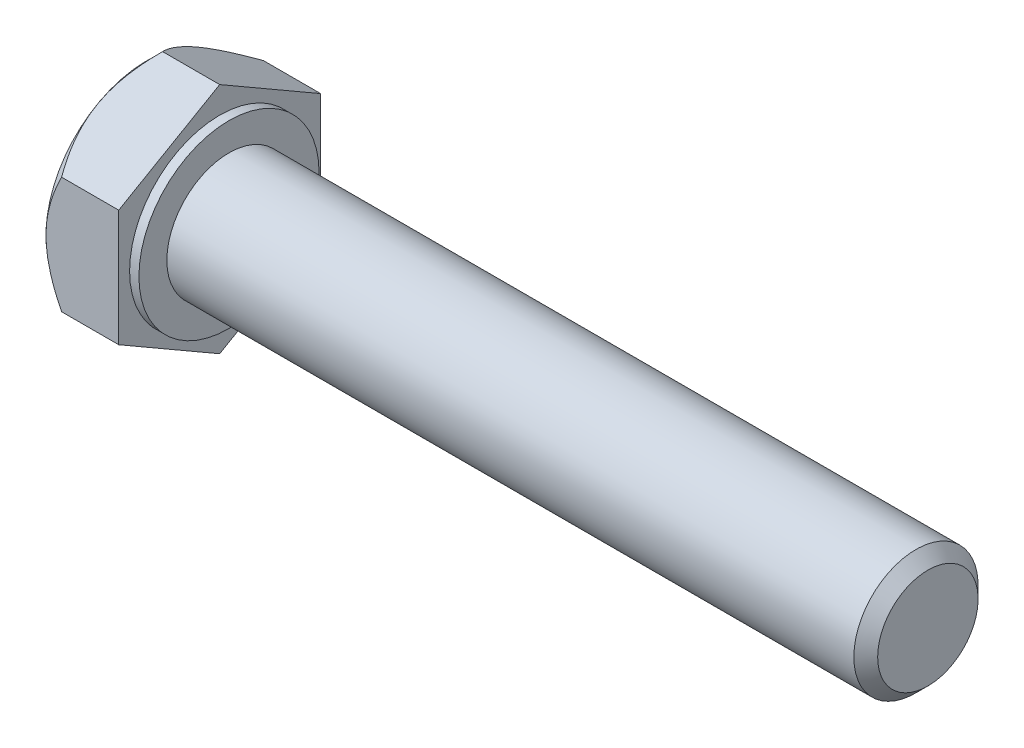
ISO-10303-21;
HEADER;
FILE_DESCRIPTION(('STEP AP214'),'2;1');
FILE_NAME('part.step','',(''),(''),'','','');
FILE_SCHEMA(('AUTOMOTIVE_DESIGN { 1 0 10303 214 1 1 1 1 }'));
ENDSEC;
DATA;
#1=APPLICATION_CONTEXT('core data for automotive mechanical design processes');
#2=APPLICATION_PROTOCOL_DEFINITION('international standard','automotive_design',2000,#1);
#3=PRODUCT_CONTEXT('',#1,'mechanical');
#4=PRODUCT('Part','Part','',(#3));
#5=PRODUCT_RELATED_PRODUCT_CATEGORY('part','',(#4));
#6=PRODUCT_DEFINITION_FORMATION('','',#4);
#7=PRODUCT_DEFINITION_CONTEXT('part definition',#1,'design');
#8=PRODUCT_DEFINITION('design','',#6,#7);
#9=PRODUCT_DEFINITION_SHAPE('','',#8);
#10=(LENGTH_UNIT() NAMED_UNIT(*) SI_UNIT(.MILLI.,.METRE.));
#11=(NAMED_UNIT(*) PLANE_ANGLE_UNIT() SI_UNIT($,.RADIAN.));
#12=(NAMED_UNIT(*) SI_UNIT($,.STERADIAN.) SOLID_ANGLE_UNIT());
#13=UNCERTAINTY_MEASURE_WITH_UNIT(LENGTH_MEASURE(1.E-05),#10,'distance_accuracy_value','');
#14=(GEOMETRIC_REPRESENTATION_CONTEXT(3) GLOBAL_UNCERTAINTY_ASSIGNED_CONTEXT((#13)) GLOBAL_UNIT_ASSIGNED_CONTEXT((#10,
#11,#12)) REPRESENTATION_CONTEXT('',''));
#15=CARTESIAN_POINT('',(0.,0.,0.));
#16=DIRECTION('',(0.,0.,1.));
#17=DIRECTION('',(1.,0.,0.));
#18=AXIS2_PLACEMENT_3D('',#15,#16,#17);
#19=CARTESIAN_POINT('',(0.,0.,0.));
#20=DIRECTION('',(1.,0.,0.));
#21=DIRECTION('',(0.,0.,-1.));
#22=AXIS2_PLACEMENT_3D('',#19,#20,#21);
#23=PLANE('',#22);
#24=CARTESIAN_POINT('',(-5.6843418860808E-11,0.,0.));
#25=DIRECTION('',(1.,0.,0.));
#26=DIRECTION('',(0.,0.,-1.));
#27=AXIS2_PLACEMENT_3D('',#24,#25,#26);
#28=CIRCLE('',#27,6.4841770377484);
#29=CARTESIAN_POINT('',(-5.6843418860808E-11,0.,-6.4841770377484));
#30=VERTEX_POINT('',#29);
#31=EDGE_CURVE('E86',#30,#30,#28,.T.);
#32=ORIENTED_EDGE('',*,*,#31,.F.);
#33=EDGE_LOOP('',(#32));
#34=FACE_BOUND('',#33,.T.);
#35=ADVANCED_FACE('F17',(#34),#23,.F.);
#36=CARTESIAN_POINT('',(1.02750472035495,0.,0.));
#37=DIRECTION('',(1.,0.,0.));
#38=DIRECTION('',(0.,0.,-1.));
#39=AXIS2_PLACEMENT_3D('',#36,#37,#38);
#40=CONICAL_SURFACE('',#39,7.51168175816019,0.785398163397448);
#41=ORIENTED_EDGE('',*,*,#31,.T.);
#42=EDGE_LOOP('',(#41));
#43=FACE_BOUND('',#42,.T.);
#44=CARTESIAN_POINT('',(1.02137646167367,-7.50555349946932,-2.08076854605376E-11));
#45=CARTESIAN_POINT('',(0.956863348740316,-7.44103070347889,0.111756760889576));
#46=CARTESIAN_POINT('',(0.894330169112702,-7.37601197251588,0.224372506364791));
#47=CARTESIAN_POINT('',(0.773825914126035,-7.24488536401594,0.451490454513631));
#48=CARTESIAN_POINT('',(0.715857330101363,-7.17877691519486,0.565993646680406));
#49=CARTESIAN_POINT('',(0.549207608741091,-6.97805705245591,0.913650647031087));
#50=CARTESIAN_POINT('',(0.448493296490026,-6.84174655858952,1.14974734801319));
#51=CARTESIAN_POINT('',(0.276027544551549,-6.56686563660067,1.62585507092975));
#52=CARTESIAN_POINT('',(0.203841659133473,-6.42836544797367,1.86574443448939));
#53=CARTESIAN_POINT('',(0.120340749585083,-6.21833845254527,2.22952186153234));
#54=CARTESIAN_POINT('',(0.0966479300984003,-6.14802026813678,2.35131652962386));
#55=CARTESIAN_POINT('',(0.0580576827015403,-6.00678859048912,2.5959369709478));
#56=CARTESIAN_POINT('',(0.043158940716158,-5.93587518779878,2.71876258734507));
#57=CARTESIAN_POINT('',(0.0181784039369678,-5.76306282402912,3.01808238157018));
#58=CARTESIAN_POINT('',(0.0129377529325743,-5.66097765373195,3.19489908322421));
#59=CARTESIAN_POINT('',(0.0217387822876304,-5.45699137253924,3.54821368629703));
#60=CARTESIAN_POINT('',(0.035787221277361,-5.35509033869147,3.72471145426515));
#61=CARTESIAN_POINT('',(0.0823383285782922,-5.15224904988364,4.07604287235307));
#62=CARTESIAN_POINT('',(0.114861629603941,-5.05130999763312,4.25087443931882));
#63=CARTESIAN_POINT('',(0.196594315231749,-4.85116681412106,4.59753260195028));
#64=CARTESIAN_POINT('',(0.245802420146347,-4.75196255041853,4.76935942701053));
#65=CARTESIAN_POINT('',(0.347031256569281,-4.57586927649479,5.07436192431759));
#66=CARTESIAN_POINT('',(0.39638818776403,-4.4985901066428,5.20821337286799));
#67=CARTESIAN_POINT('',(0.50305460921505,-4.34541880414507,5.47351385105556));
#68=CARTESIAN_POINT('',(0.560364339235519,-4.26952671339565,5.60496280812617));
#69=CARTESIAN_POINT('',(0.681651981959655,-4.11936862445095,5.86504424734585));
#70=CARTESIAN_POINT('',(0.745608922548562,-4.04509835593153,5.99368412591326));
#71=CARTESIAN_POINT('',(0.879351576193868,-3.89793287352954,6.2485822185539));
#72=CARTESIAN_POINT('',(0.949133717029406,-3.82503685004989,6.37484183489038));
#73=CARTESIAN_POINT('',(1.02137646167042,-3.75277674972205,6.50000000001823));
#74=B_SPLINE_CURVE_WITH_KNOTS('',3,(#44,#45,#46,#47,#48,#49,#50,#51,#52,#53,#54,#55,#56,#57,#58,
#59,#60,#61,#62,#63,#64,#65,#66,#67,#68,#69,#70,#71,#72,#73),.UNSPECIFIED.,.F.,.F.,(4,2,2,2,2,2,
2,2,2,2,2,2,2,2,4),(0.,0.432793757371348,0.865822117364595,1.73655298412524,2.59345958881553,
3.021072682735,3.44862186340034,4.06038261741554,4.67235777864492,5.28501774083525,
5.89763072398653,6.38414619494485,6.87067633675643,7.35571555795712,7.84045949061832),.UNSPECIFIED.);
#75=CARTESIAN_POINT('',(1.0213764616707,-7.50555349947593,0.));
#76=VERTEX_POINT('',#75);
#77=CARTESIAN_POINT('',(1.0213764616707,-3.75277674973797,6.50000000000935));
#78=VERTEX_POINT('',#77);
#79=EDGE_CURVE('E68',#76,#78,#74,.T.);
#80=ORIENTED_EDGE('',*,*,#79,.T.);
#81=CARTESIAN_POINT('',(1.02137646167367,-3.75277674975268,6.49999999999322));
#82=CARTESIAN_POINT('',(0.956863348740316,-3.62373115776441,6.4999999999975));
#83=CARTESIAN_POINT('',(0.894330169112703,-3.49369369583525,6.49999999999932));
#84=CARTESIAN_POINT('',(0.773825914126036,-3.23144047883298,6.50000000000069));
#85=CARTESIAN_POINT('',(0.715857330101364,-3.09922358119161,6.50000000000024));
#86=CARTESIAN_POINT('',(0.549207608741092,-2.69778385571495,6.49999999999952));
#87=CARTESIAN_POINT('',(0.448493296490026,-2.42516286798156,6.49999999999988));
#88=CARTESIAN_POINT('',(0.276027544551549,-1.87540102400343,6.50000000000012));
#89=CARTESIAN_POINT('',(0.203841659133473,-1.59840064674959,6.50000000000002));
#90=CARTESIAN_POINT('',(0.120340749585082,-1.17834665589286,6.49999999999999));
#91=CARTESIAN_POINT('',(0.0966479300983987,-1.03771028707586,6.5));
#92=CARTESIAN_POINT('',(0.0580576827015386,-0.755246931780536,6.5));
#93=CARTESIAN_POINT('',(0.043158940716157,-0.613420126399845,6.5));
#94=CARTESIAN_POINT('',(0.0181784039369671,-0.267795398860543,6.5));
#95=CARTESIAN_POINT('',(0.0129377529325726,-0.0636250582661894,6.5));
#96=CARTESIAN_POINT('',(0.0217387822876289,0.344347504119238,6.5));
#97=CARTESIAN_POINT('',(0.0357872212773607,0.54814957181477,6.5));
#98=CARTESIAN_POINT('',(0.082338328578292,0.953832149430432,6.5));
#99=CARTESIAN_POINT('',(0.114861629603939,1.15571025393147,6.5));
#100=CARTESIAN_POINT('',(0.196594315231747,1.55599662095558,6.5));
#101=CARTESIAN_POINT('',(0.245802420146346,1.75440514836065,6.5));
#102=CARTESIAN_POINT('',(0.347031256569281,2.10659169620813,6.5));
#103=CARTESIAN_POINT('',(0.396388187764029,2.26115003591211,6.5));
#104=CARTESIAN_POINT('',(0.503054609215049,2.56749264090757,6.5));
#105=CARTESIAN_POINT('',(0.560364339235518,2.7192768224064,6.5));
#106=CARTESIAN_POINT('',(0.681651981959655,3.01959300029581,6.5));
#107=CARTESIAN_POINT('',(0.745608922548561,3.16813353733465,6.5));
#108=CARTESIAN_POINT('',(0.879351576193866,3.46246450213863,6.5));
#109=CARTESIAN_POINT('',(0.949133717029405,3.60825654909793,6.5));
#110=CARTESIAN_POINT('',(1.02137646167042,3.75277674975362,6.5));
#111=B_SPLINE_CURVE_WITH_KNOTS('',3,(#81,#82,#83,#84,#85,#86,#87,#88,#89,#90,#91,#92,#93,#94,
#95,#96,#97,#98,#99,#100,#101,#102,#103,#104,#105,#106,#107,#108,#109,#110),.UNSPECIFIED.,.F.,
.F.,(4,2,2,2,2,2,2,2,2,2,2,2,2,2,4),(0.,0.432793757371348,0.865822117364594,1.73655298412524,
2.59345958881554,3.021072682735,3.44862186340035,4.06038261741554,4.67235777864492,
5.28501774083526,5.89763072398654,6.38414619494486,6.87067633675644,7.35571555795712,
7.84045949061832),.UNSPECIFIED.);
#112=CARTESIAN_POINT('',(1.0213764616653,3.75277674974337,6.5));
#113=VERTEX_POINT('',#112);
#114=EDGE_CURVE('E71',#78,#113,#111,.T.);
#115=ORIENTED_EDGE('',*,*,#114,.T.);
#116=CARTESIAN_POINT('',(1.02137646167367,3.75277674971664,6.50000000001403));
#117=CARTESIAN_POINT('',(0.956863348740314,3.81729954571448,6.38824323910793));
#118=CARTESIAN_POINT('',(0.894330169112701,3.88231827668063,6.27562749363453));
#119=CARTESIAN_POINT('',(0.773825914126032,4.01344488518295,6.04850954548705));
#120=CARTESIAN_POINT('',(0.71585733010136,4.07955333400325,5.93400635331983));
#121=CARTESIAN_POINT('',(0.549207608741086,4.28027319674096,5.58634935296843));
#122=CARTESIAN_POINT('',(0.448493296490022,4.41658369060796,5.35025265198669));
#123=CARTESIAN_POINT('',(0.276027544551545,4.69146461259724,4.87414492907038));
#124=CARTESIAN_POINT('',(0.203841659133469,4.82996480122407,4.63425556551063));
#125=CARTESIAN_POINT('',(0.120340749585078,5.03999179665241,4.27047813846764));
#126=CARTESIAN_POINT('',(0.0966479300983942,5.11030998106092,4.14868347037613));
#127=CARTESIAN_POINT('',(0.0580576827015339,5.25154165870858,3.90406302905219));
#128=CARTESIAN_POINT('',(0.0431589407161522,5.32245506139893,3.78123741265492));
#129=CARTESIAN_POINT('',(0.0181784039369623,5.49526742516858,3.48191761842981));
#130=CARTESIAN_POINT('',(0.0129377529325681,5.59735259546575,3.30510091677578));
#131=CARTESIAN_POINT('',(0.0217387822876244,5.80133887665847,2.95178631370297));
#132=CARTESIAN_POINT('',(0.035787221277356,5.90323991050623,2.77528854573484));
#133=CARTESIAN_POINT('',(0.0823383285782876,6.10608119931406,2.42395712764693));
#134=CARTESIAN_POINT('',(0.114861629603936,6.20702025156459,2.24912556068118));
#135=CARTESIAN_POINT('',(0.196594315231743,6.40716343507664,1.90246739804972));
#136=CARTESIAN_POINT('',(0.245802420146341,6.50636769877917,1.73064057298947));
#137=CARTESIAN_POINT('',(0.347031256569276,6.68246097270291,1.42563807568241));
#138=CARTESIAN_POINT('',(0.396388187764025,6.75974014255491,1.29178662713201));
#139=CARTESIAN_POINT('',(0.503054609215045,6.91291144505263,1.02648614894444));
#140=CARTESIAN_POINT('',(0.560364339235514,6.98880353580205,0.895037191873826));
#141=CARTESIAN_POINT('',(0.681651981959651,7.13896162474675,0.63495575265415));
#142=CARTESIAN_POINT('',(0.745608922548557,7.21323189326617,0.506315874086734));
#143=CARTESIAN_POINT('',(0.879351576193862,7.36039737566816,0.251417781446103));
#144=CARTESIAN_POINT('',(0.9491337170294,7.43329339914781,0.125158165109614));
#145=CARTESIAN_POINT('',(1.02137646167042,7.50555349947566,-1.8231203927878E-11));
#146=B_SPLINE_CURVE_WITH_KNOTS('',3,(#116,#117,#118,#119,#120,#121,#122,#123,#124,#125,#126,
#127,#128,#129,#130,#131,#132,#133,#134,#135,#136,#137,#138,#139,#140,#141,#142,#143,#144,#145),
.UNSPECIFIED.,.F.,.F.,(4,2,2,2,2,2,2,2,2,2,2,2,2,2,4),(0.,0.432793757371349,0.865822117364596,
1.73655298412524,2.59345958881554,3.02107268273501,3.44862186340035,4.06038261741555,
4.67235777864493,5.28501774083526,5.89763072398654,6.38414619494486,6.87067633675644,
7.35571555795712,7.84045949061833),.UNSPECIFIED.);
#147=CARTESIAN_POINT('',(1.02137646167069,7.50555349947593,0.));
#148=VERTEX_POINT('',#147);
#149=EDGE_CURVE('E145',#113,#148,#146,.T.);
#150=ORIENTED_EDGE('',*,*,#149,.T.);
#151=CARTESIAN_POINT('',(1.02137646167367,7.50555349946932,2.0807260441963E-11));
#152=CARTESIAN_POINT('',(0.956863348740315,7.44103070347889,-0.111756760889577));
#153=CARTESIAN_POINT('',(0.894330169112702,7.37601197251588,-0.224372506364792));
#154=CARTESIAN_POINT('',(0.773825914126035,7.24488536401594,-0.451490454513632));
#155=CARTESIAN_POINT('',(0.715857330101363,7.17877691519486,-0.565993646680407));
#156=CARTESIAN_POINT('',(0.549207608741091,6.97805705245591,-0.913650647031087));
#157=CARTESIAN_POINT('',(0.448493296490026,6.84174655858952,-1.14974734801319));
#158=CARTESIAN_POINT('',(0.276027544551548,6.56686563660067,-1.62585507092975));
#159=CARTESIAN_POINT('',(0.203841659133473,6.42836544797367,-1.86574443448939));
#160=CARTESIAN_POINT('',(0.120340749585083,6.21833845254527,-2.22952186153234));
#161=CARTESIAN_POINT('',(0.0966479300983999,6.14802026813678,-2.35131652962386));
#162=CARTESIAN_POINT('',(0.0580576827015398,6.00678859048912,-2.5959369709478));
#163=CARTESIAN_POINT('',(0.0431589407161576,5.93587518779878,-2.71876258734507));
#164=CARTESIAN_POINT('',(0.0181784039369676,5.76306282402912,-3.01808238157018));
#165=CARTESIAN_POINT('',(0.0129377529325742,5.66097765373195,-3.19489908322421));
#166=CARTESIAN_POINT('',(0.0217387822876305,5.45699137253924,-3.54821368629703));
#167=CARTESIAN_POINT('',(0.0357872212773611,5.35509033869147,-3.72471145426515));
#168=CARTESIAN_POINT('',(0.0823383285782919,5.15224904988364,-4.07604287235307));
#169=CARTESIAN_POINT('',(0.11486162960394,5.05130999763312,-4.25087443931882));
#170=CARTESIAN_POINT('',(0.196594315231748,4.85116681412107,-4.59753260195028));
#171=CARTESIAN_POINT('',(0.245802420146347,4.75196255041853,-4.76935942701053));
#172=CARTESIAN_POINT('',(0.347031256569281,4.57586927649479,-5.07436192431759));
#173=CARTESIAN_POINT('',(0.39638818776403,4.4985901066428,-5.20821337286799));
#174=CARTESIAN_POINT('',(0.50305460921505,4.34541880414507,-5.47351385105555));
#175=CARTESIAN_POINT('',(0.560364339235519,4.26952671339565,-5.60496280812617));
#176=CARTESIAN_POINT('',(0.681651981959656,4.11936862445095,-5.86504424734585));
#177=CARTESIAN_POINT('',(0.745608922548562,4.04509835593153,-5.99368412591326));
#178=CARTESIAN_POINT('',(0.879351576193868,3.89793287352954,-6.2485822185539));
#179=CARTESIAN_POINT('',(0.949133717029406,3.82503685004989,-6.37484183489039));
#180=CARTESIAN_POINT('',(1.02137646167042,3.75277674972205,-6.50000000001823));
#181=B_SPLINE_CURVE_WITH_KNOTS('',3,(#151,#152,#153,#154,#155,#156,#157,#158,#159,#160,#161,
#162,#163,#164,#165,#166,#167,#168,#169,#170,#171,#172,#173,#174,#175,#176,#177,#178,#179,#180),
.UNSPECIFIED.,.F.,.F.,(4,2,2,2,2,2,2,2,2,2,2,2,2,2,4),(0.,0.432793757371348,0.865822117364594,
1.73655298412524,2.59345958881553,3.021072682735,3.44862186340034,4.06038261741554,
4.67235777864491,5.28501774083525,5.89763072398653,6.38414619494485,6.87067633675643,
7.35571555795711,7.84045949061832),.UNSPECIFIED.);
#182=CARTESIAN_POINT('',(1.0213764616707,3.75277674973797,-6.50000000000935));
#183=VERTEX_POINT('',#182);
#184=EDGE_CURVE('E152',#148,#183,#181,.T.);
#185=ORIENTED_EDGE('',*,*,#184,.T.);
#186=CARTESIAN_POINT('',(1.02137646167367,3.75277674975268,-6.49999999999322));
#187=CARTESIAN_POINT('',(0.956863348740317,3.62373115776441,-6.4999999999975));
#188=CARTESIAN_POINT('',(0.894330169112704,3.49369369583525,-6.49999999999932));
#189=CARTESIAN_POINT('',(0.773825914126036,3.23144047883298,-6.50000000000069));
#190=CARTESIAN_POINT('',(0.715857330101364,3.09922358119161,-6.50000000000024));
#191=CARTESIAN_POINT('',(0.549207608741091,2.69778385571495,-6.49999999999952));
#192=CARTESIAN_POINT('',(0.448493296490026,2.42516286798156,-6.49999999999988));
#193=CARTESIAN_POINT('',(0.276027544551549,1.87540102400343,-6.50000000000012));
#194=CARTESIAN_POINT('',(0.203841659133473,1.59840064674959,-6.50000000000002));
#195=CARTESIAN_POINT('',(0.120340749585082,1.17834665589286,-6.49999999999999));
#196=CARTESIAN_POINT('',(0.0966479300983986,1.03771028707586,-6.5));
#197=CARTESIAN_POINT('',(0.0580576827015386,0.755246931780538,-6.5));
#198=CARTESIAN_POINT('',(0.043158940716157,0.613420126399847,-6.5));
#199=CARTESIAN_POINT('',(0.0181784039369672,0.267795398860545,-6.5));
#200=CARTESIAN_POINT('',(0.0129377529325727,0.0636250582661907,-6.5));
#201=CARTESIAN_POINT('',(0.021738782287629,-0.344347504119236,-6.5));
#202=CARTESIAN_POINT('',(0.0357872212773607,-0.548149571814768,-6.5));
#203=CARTESIAN_POINT('',(0.0823383285782919,-0.95383214943043,-6.5));
#204=CARTESIAN_POINT('',(0.114861629603939,-1.15571025393147,-6.5));
#205=CARTESIAN_POINT('',(0.196594315231747,-1.55599662095558,-6.5));
#206=CARTESIAN_POINT('',(0.245802420146346,-1.75440514836065,-6.5));
#207=CARTESIAN_POINT('',(0.34703125656928,-2.10659169620813,-6.5));
#208=CARTESIAN_POINT('',(0.396388187764029,-2.26115003591211,-6.5));
#209=CARTESIAN_POINT('',(0.503054609215048,-2.56749264090757,-6.5));
#210=CARTESIAN_POINT('',(0.560364339235517,-2.7192768224064,-6.5));
#211=CARTESIAN_POINT('',(0.681651981959654,-3.01959300029581,-6.5));
#212=CARTESIAN_POINT('',(0.745608922548559,-3.16813353733465,-6.5));
#213=CARTESIAN_POINT('',(0.879351576193864,-3.46246450213863,-6.5));
#214=CARTESIAN_POINT('',(0.949133717029402,-3.60825654909793,-6.5));
#215=CARTESIAN_POINT('',(1.02137646167042,-3.75277674975361,-6.5));
#216=B_SPLINE_CURVE_WITH_KNOTS('',3,(#186,#187,#188,#189,#190,#191,#192,#193,#194,#195,#196,
#197,#198,#199,#200,#201,#202,#203,#204,#205,#206,#207,#208,#209,#210,#211,#212,#213,#214,#215),
.UNSPECIFIED.,.F.,.F.,(4,2,2,2,2,2,2,2,2,2,2,2,2,2,4),(0.,0.432793757371348,0.865822117364595,
1.73655298412524,2.59345958881554,3.021072682735,3.44862186340035,4.06038261741554,
4.67235777864492,5.28501774083526,5.89763072398654,6.38414619494485,6.87067633675643,
7.35571555795712,7.84045949061832),.UNSPECIFIED.);
#217=CARTESIAN_POINT('',(1.0213764616707,-3.75277674973796,-6.50000000000935));
#218=VERTEX_POINT('',#217);
#219=EDGE_CURVE('E177',#183,#218,#216,.T.);
#220=ORIENTED_EDGE('',*,*,#219,.T.);
#221=CARTESIAN_POINT('',(1.02137646167367,-3.75277674971663,-6.50000000001403));
#222=CARTESIAN_POINT('',(0.956863348740315,-3.81729954571448,-6.38824323910793));
#223=CARTESIAN_POINT('',(0.894330169112702,-3.88231827668063,-6.27562749363453));
#224=CARTESIAN_POINT('',(0.773825914126033,-4.01344488518295,-6.04850954548706));
#225=CARTESIAN_POINT('',(0.715857330101361,-4.07955333400325,-5.93400635331984));
#226=CARTESIAN_POINT('',(0.549207608741087,-4.28027319674096,-5.58634935296843));
#227=CARTESIAN_POINT('',(0.448493296490022,-4.41658369060796,-5.35025265198669));
#228=CARTESIAN_POINT('',(0.276027544551545,-4.69146461259724,-4.87414492907038));
#229=CARTESIAN_POINT('',(0.203841659133468,-4.82996480122407,-4.63425556551063));
#230=CARTESIAN_POINT('',(0.120340749585077,-5.03999179665241,-4.27047813846765));
#231=CARTESIAN_POINT('',(0.0966479300983943,-5.11030998106092,-4.14868347037613));
#232=CARTESIAN_POINT('',(0.058057682701534,-5.25154165870858,-3.9040630290522));
#233=CARTESIAN_POINT('',(0.0431589407161519,-5.32245506139893,-3.78123741265493));
#234=CARTESIAN_POINT('',(0.0181784039369617,-5.49526742516857,-3.48191761842981));
#235=CARTESIAN_POINT('',(0.0129377529325679,-5.59735259546575,-3.30510091677578));
#236=CARTESIAN_POINT('',(0.0217387822876245,-5.80133887665847,-2.95178631370297));
#237=CARTESIAN_POINT('',(0.035787221277356,-5.90323991050623,-2.77528854573485));
#238=CARTESIAN_POINT('',(0.0823383285782872,-6.10608119931406,-2.42395712764693));
#239=CARTESIAN_POINT('',(0.114861629603935,-6.20702025156458,-2.24912556068118));
#240=CARTESIAN_POINT('',(0.196594315231742,-6.40716343507664,-1.90246739804972));
#241=CARTESIAN_POINT('',(0.245802420146341,-6.50636769877917,-1.73064057298947));
#242=CARTESIAN_POINT('',(0.347031256569275,-6.68246097270291,-1.42563807568241));
#243=CARTESIAN_POINT('',(0.396388187764024,-6.7597401425549,-1.29178662713201));
#244=CARTESIAN_POINT('',(0.503054609215044,-6.91291144505263,-1.02648614894444));
#245=CARTESIAN_POINT('',(0.560364339235513,-6.98880353580205,-0.895037191873828));
#246=CARTESIAN_POINT('',(0.68165198195965,-7.13896162474675,-0.634955752654151));
#247=CARTESIAN_POINT('',(0.745608922548556,-7.21323189326617,-0.506315874086734));
#248=CARTESIAN_POINT('',(0.879351576193862,-7.36039737566816,-0.251417781446102));
#249=CARTESIAN_POINT('',(0.949133717029401,-7.43329339914781,-0.125158165109613));
#250=CARTESIAN_POINT('',(1.02137646167042,-7.50555349947566,1.82324864022605E-11));
#251=B_SPLINE_CURVE_WITH_KNOTS('',3,(#221,#222,#223,#224,#225,#226,#227,#228,#229,#230,#231,
#232,#233,#234,#235,#236,#237,#238,#239,#240,#241,#242,#243,#244,#245,#246,#247,#248,#249,#250),
.UNSPECIFIED.,.F.,.F.,(4,2,2,2,2,2,2,2,2,2,2,2,2,2,4),(0.,0.432793757371349,0.865822117364596,
1.73655298412524,2.59345958881554,3.02107268273501,3.44862186340035,4.06038261741554,
4.67235777864492,5.28501774083526,5.89763072398654,6.38414619494486,6.87067633675644,
7.35571555795712,7.84045949061833),.UNSPECIFIED.);
#252=EDGE_CURVE('E74',#218,#76,#251,.T.);
#253=ORIENTED_EDGE('',*,*,#252,.T.);
#254=EDGE_LOOP('',(#80,#115,#150,#185,#220,#253));
#255=FACE_BOUND('',#254,.T.);
#256=ADVANCED_FACE('F70',(#43,#255),#40,.T.);
#257=CARTESIAN_POINT('',(4.7,3.75277674973257,6.5));
#258=DIRECTION('',(0.,0.,-1.));
#259=DIRECTION('',(-1.,0.,0.));
#260=AXIS2_PLACEMENT_3D('',#257,#258,#259);
#261=PLANE('',#260);
#262=ORIENTED_EDGE('',*,*,#114,.F.);
#263=DIRECTION('',(1.,0.,0.));
#264=VECTOR('',#263,1.);
#265=CARTESIAN_POINT('',(4.7,-3.75277674973257,6.5));
#266=LINE('',#265,#264);
#267=CARTESIAN_POINT('',(4.7,-3.75277674973257,6.5));
#268=VERTEX_POINT('',#267);
#269=EDGE_CURVE('E78',#78,#268,#266,.T.);
#270=ORIENTED_EDGE('',*,*,#269,.T.);
#271=DIRECTION('',(0.,1.,0.));
#272=VECTOR('',#271,1.);
#273=CARTESIAN_POINT('',(4.7,0.,6.5));
#274=LINE('',#273,#272);
#275=CARTESIAN_POINT('',(4.7,3.75277674973257,6.5));
#276=VERTEX_POINT('',#275);
#277=EDGE_CURVE('E113',#276,#268,#274,.F.);
#278=ORIENTED_EDGE('',*,*,#277,.F.);
#279=DIRECTION('',(1.,0.,0.));
#280=VECTOR('',#279,1.);
#281=CARTESIAN_POINT('',(4.7,3.75277674973256,6.5));
#282=LINE('',#281,#280);
#283=EDGE_CURVE('E84',#276,#113,#282,.F.);
#284=ORIENTED_EDGE('',*,*,#283,.T.);
#285=EDGE_LOOP('',(#262,#270,#278,#284));
#286=FACE_BOUND('',#285,.T.);
#287=ADVANCED_FACE('F81',(#286),#261,.F.);
#288=CARTESIAN_POINT('',(4.7,-3.75277674973257,6.5));
#289=DIRECTION('',(0.,0.866025403784439,-0.5));
#290=DIRECTION('',(0.,0.5,0.866025403784439));
#291=AXIS2_PLACEMENT_3D('',#288,#289,#290);
#292=PLANE('',#291);
#293=ORIENTED_EDGE('',*,*,#79,.F.);
#294=DIRECTION('',(1.,0.,0.));
#295=VECTOR('',#294,1.);
#296=CARTESIAN_POINT('',(4.7,-7.50555349946513,0.));
#297=LINE('',#296,#295);
#298=CARTESIAN_POINT('',(4.7,-7.50555349946513,0.));
#299=VERTEX_POINT('',#298);
#300=EDGE_CURVE('E93',#76,#299,#297,.T.);
#301=ORIENTED_EDGE('',*,*,#300,.T.);
#302=DIRECTION('',(0.,-0.499999999999999,-0.866025403784439));
#303=VECTOR('',#302,1.);
#304=CARTESIAN_POINT('',(4.7,-3.75277674973257,6.5));
#305=LINE('',#304,#303);
#306=EDGE_CURVE('E90',#268,#299,#305,.T.);
#307=ORIENTED_EDGE('',*,*,#306,.F.);
#308=ORIENTED_EDGE('',*,*,#269,.F.);
#309=EDGE_LOOP('',(#293,#301,#307,#308));
#310=FACE_BOUND('',#309,.T.);
#311=ADVANCED_FACE('F88',(#310),#292,.F.);
#312=CARTESIAN_POINT('',(4.7,-7.50555349946513,0.));
#313=DIRECTION('',(0.,0.866025403784439,0.5));
#314=DIRECTION('',(0.,-0.5,0.866025403784439));
#315=AXIS2_PLACEMENT_3D('',#312,#313,#314);
#316=PLANE('',#315);
#317=ORIENTED_EDGE('',*,*,#252,.F.);
#318=DIRECTION('',(1.,0.,0.));
#319=VECTOR('',#318,1.);
#320=CARTESIAN_POINT('',(4.7,-3.75277674973256,-6.5));
#321=LINE('',#320,#319);
#322=CARTESIAN_POINT('',(4.7,-3.75277674973256,-6.5));
#323=VERTEX_POINT('',#322);
#324=EDGE_CURVE('E248',#218,#323,#321,.T.);
#325=ORIENTED_EDGE('',*,*,#324,.T.);
#326=DIRECTION('',(0.,0.499999999999999,-0.866025403784439));
#327=VECTOR('',#326,1.);
#328=CARTESIAN_POINT('',(4.7,-7.50555349946513,0.));
#329=LINE('',#328,#327);
#330=EDGE_CURVE('E119',#299,#323,#329,.T.);
#331=ORIENTED_EDGE('',*,*,#330,.F.);
#332=ORIENTED_EDGE('',*,*,#300,.F.);
#333=EDGE_LOOP('',(#317,#325,#331,#332));
#334=FACE_BOUND('',#333,.T.);
#335=ADVANCED_FACE('F192',(#334),#316,.F.);
#336=CARTESIAN_POINT('',(4.7,-3.75277674973257,-6.5));
#337=DIRECTION('',(0.,0.,1.));
#338=DIRECTION('',(1.,0.,0.));
#339=AXIS2_PLACEMENT_3D('',#336,#337,#338);
#340=PLANE('',#339);
#341=ORIENTED_EDGE('',*,*,#219,.F.);
#342=DIRECTION('',(1.,0.,0.));
#343=VECTOR('',#342,1.);
#344=CARTESIAN_POINT('',(4.7,3.75277674973257,-6.5));
#345=LINE('',#344,#343);
#346=CARTESIAN_POINT('',(4.7,3.75277674973257,-6.5));
#347=VERTEX_POINT('',#346);
#348=EDGE_CURVE('E243',#183,#347,#345,.T.);
#349=ORIENTED_EDGE('',*,*,#348,.T.);
#350=DIRECTION('',(0.,1.,0.));
#351=VECTOR('',#350,1.);
#352=CARTESIAN_POINT('',(4.7,0.,-6.5));
#353=LINE('',#352,#351);
#354=EDGE_CURVE('E110',#323,#347,#353,.T.);
#355=ORIENTED_EDGE('',*,*,#354,.F.);
#356=ORIENTED_EDGE('',*,*,#324,.F.);
#357=EDGE_LOOP('',(#341,#349,#355,#356));
#358=FACE_BOUND('',#357,.T.);
#359=ADVANCED_FACE('F195',(#358),#340,.F.);
#360=CARTESIAN_POINT('',(4.7,3.75277674973257,-6.5));
#361=DIRECTION('',(0.,-0.866025403784439,0.5));
#362=DIRECTION('',(0.,-0.5,-0.866025403784439));
#363=AXIS2_PLACEMENT_3D('',#360,#361,#362);
#364=PLANE('',#363);
#365=ORIENTED_EDGE('',*,*,#184,.F.);
#366=DIRECTION('',(1.,0.,0.));
#367=VECTOR('',#366,1.);
#368=CARTESIAN_POINT('',(4.7,7.50555349946513,0.));
#369=LINE('',#368,#367);
#370=CARTESIAN_POINT('',(4.7,7.50555349946513,0.));
#371=VERTEX_POINT('',#370);
#372=EDGE_CURVE('E35',#148,#371,#369,.T.);
#373=ORIENTED_EDGE('',*,*,#372,.T.);
#374=DIRECTION('',(0.,0.499999999999999,0.866025403784439));
#375=VECTOR('',#374,1.);
#376=CARTESIAN_POINT('',(4.7,3.75277674973257,-6.5));
#377=LINE('',#376,#375);
#378=EDGE_CURVE('E105',#347,#371,#377,.T.);
#379=ORIENTED_EDGE('',*,*,#378,.F.);
#380=ORIENTED_EDGE('',*,*,#348,.F.);
#381=EDGE_LOOP('',(#365,#373,#379,#380));
#382=FACE_BOUND('',#381,.T.);
#383=ADVANCED_FACE('F233',(#382),#364,.F.);
#384=CARTESIAN_POINT('',(4.7,7.50555349946513,0.));
#385=DIRECTION('',(0.,-0.866025403784439,-0.5));
#386=DIRECTION('',(0.,0.5,-0.866025403784439));
#387=AXIS2_PLACEMENT_3D('',#384,#385,#386);
#388=PLANE('',#387);
#389=ORIENTED_EDGE('',*,*,#149,.F.);
#390=ORIENTED_EDGE('',*,*,#283,.F.);
#391=DIRECTION('',(0.,-0.499999999999999,0.866025403784439));
#392=VECTOR('',#391,1.);
#393=CARTESIAN_POINT('',(4.7,7.50555349946513,0.));
#394=LINE('',#393,#392);
#395=EDGE_CURVE('E101',#371,#276,#394,.T.);
#396=ORIENTED_EDGE('',*,*,#395,.F.);
#397=ORIENTED_EDGE('',*,*,#372,.F.);
#398=EDGE_LOOP('',(#389,#390,#396,#397));
#399=FACE_BOUND('',#398,.T.);
#400=ADVANCED_FACE('F159',(#399),#388,.F.);
#401=CARTESIAN_POINT('',(4.7,0.,0.));
#402=DIRECTION('',(1.,0.,0.));
#403=DIRECTION('',(0.,0.,-1.));
#404=AXIS2_PLACEMENT_3D('',#401,#402,#403);
#405=PLANE('',#404);
#406=ORIENTED_EDGE('',*,*,#378,.T.);
#407=ORIENTED_EDGE('',*,*,#395,.T.);
#408=ORIENTED_EDGE('',*,*,#277,.T.);
#409=ORIENTED_EDGE('',*,*,#306,.T.);
#410=ORIENTED_EDGE('',*,*,#330,.T.);
#411=ORIENTED_EDGE('',*,*,#354,.T.);
#412=EDGE_LOOP('',(#406,#407,#408,#409,#410,#411));
#413=FACE_BOUND('',#412,.T.);
#414=CARTESIAN_POINT('',(4.7,0.,0.));
#415=DIRECTION('',(-1.,0.,0.));
#416=DIRECTION('',(0.,0.,1.));
#417=AXIS2_PLACEMENT_3D('',#414,#415,#416);
#418=CIRCLE('',#417,5.8);
#419=CARTESIAN_POINT('',(4.7,0.,5.8));
#420=VERTEX_POINT('',#419);
#421=EDGE_CURVE('E104',#420,#420,#418,.F.);
#422=ORIENTED_EDGE('',*,*,#421,.F.);
#423=EDGE_LOOP('',(#422));
#424=FACE_BOUND('',#423,.T.);
#425=ADVANCED_FACE('F226',(#413,#424),#405,.T.);
#426=CARTESIAN_POINT('',(50.3,3.233,0.));
#427=DIRECTION('',(-1.,0.,0.));
#428=DIRECTION('',(0.,0.,1.));
#429=AXIS2_PLACEMENT_3D('',#426,#427,#428);
#430=PLANE('',#429);
#431=CARTESIAN_POINT('',(50.2999999999361,0.,0.));
#432=DIRECTION('',(-1.,0.,0.));
#433=DIRECTION('',(0.,0.,1.));
#434=AXIS2_PLACEMENT_3D('',#431,#432,#433);
#435=CIRCLE('',#434,3.23299999996607);
#436=CARTESIAN_POINT('',(50.2999999999361,0.,3.23299999996607));
#437=VERTEX_POINT('',#436);
#438=EDGE_CURVE('E134',#437,#437,#435,.T.);
#439=ORIENTED_EDGE('',*,*,#438,.F.);
#440=EDGE_LOOP('',(#439));
#441=FACE_BOUND('',#440,.T.);
#442=ADVANCED_FACE('F223',(#441),#430,.F.);
#443=CARTESIAN_POINT('',(5.29999999999995,0.,0.));
#444=DIRECTION('',(-1.,0.,0.));
#445=DIRECTION('',(0.,0.,1.));
#446=AXIS2_PLACEMENT_3D('',#443,#444,#445);
#447=CYLINDRICAL_SURFACE('',#446,5.8);
#448=ORIENTED_EDGE('',*,*,#421,.T.);
#449=EDGE_LOOP('',(#448));
#450=FACE_BOUND('',#449,.T.);
#451=CARTESIAN_POINT('',(5.3,0.,0.));
#452=DIRECTION('',(-1.,0.,0.));
#453=DIRECTION('',(0.,0.,1.));
#454=AXIS2_PLACEMENT_3D('',#451,#452,#453);
#455=CIRCLE('',#454,5.8);
#456=CARTESIAN_POINT('',(5.3,0.,5.8));
#457=VERTEX_POINT('',#456);
#458=EDGE_CURVE('E131',#457,#457,#455,.T.);
#459=ORIENTED_EDGE('',*,*,#458,.T.);
#460=EDGE_LOOP('',(#459));
#461=FACE_BOUND('',#460,.T.);
#462=ADVANCED_FACE('F219',(#450,#461),#447,.T.);
#463=CARTESIAN_POINT('',(49.5329999999399,0.,0.));
#464=DIRECTION('',(-1.,0.,0.));
#465=DIRECTION('',(0.,0.,1.));
#466=AXIS2_PLACEMENT_3D('',#463,#464,#465);
#467=CONICAL_SURFACE('',#466,4.0000000000191,0.785398163434504);
#468=CARTESIAN_POINT('',(49.533,0.,0.));
#469=DIRECTION('',(-1.,0.,0.));
#470=DIRECTION('',(0.,0.,1.));
#471=AXIS2_PLACEMENT_3D('',#468,#469,#470);
#472=CIRCLE('',#471,4.);
#473=CARTESIAN_POINT('',(49.533,0.,4.));
#474=VERTEX_POINT('',#473);
#475=EDGE_CURVE('E26',#474,#474,#472,.T.);
#476=ORIENTED_EDGE('',*,*,#475,.F.);
#477=EDGE_LOOP('',(#476));
#478=FACE_BOUND('',#477,.T.);
#479=ORIENTED_EDGE('',*,*,#438,.T.);
#480=EDGE_LOOP('',(#479));
#481=FACE_BOUND('',#480,.T.);
#482=ADVANCED_FACE('F212',(#478,#481),#467,.T.);
#483=CARTESIAN_POINT('',(5.29999999999998,5.80000000000001,0.));
#484=DIRECTION('',(-1.,0.,0.));
#485=DIRECTION('',(0.,0.,1.));
#486=AXIS2_PLACEMENT_3D('',#483,#484,#485);
#487=PLANE('',#486);
#488=ORIENTED_EDGE('',*,*,#458,.F.);
#489=EDGE_LOOP('',(#488));
#490=FACE_BOUND('',#489,.T.);
#491=CARTESIAN_POINT('',(5.3,0.,0.));
#492=DIRECTION('',(-1.,0.,0.));
#493=DIRECTION('',(0.,0.,1.));
#494=AXIS2_PLACEMENT_3D('',#491,#492,#493);
#495=CIRCLE('',#494,4.);
#496=CARTESIAN_POINT('',(5.3,0.,4.));
#497=VERTEX_POINT('',#496);
#498=EDGE_CURVE('E11',#497,#497,#495,.F.);
#499=ORIENTED_EDGE('',*,*,#498,.F.);
#500=EDGE_LOOP('',(#499));
#501=FACE_BOUND('',#500,.T.);
#502=ADVANCED_FACE('F206',(#490,#501),#487,.F.);
#503=CARTESIAN_POINT('',(50.3,0.,0.));
#504=DIRECTION('',(-1.,0.,0.));
#505=DIRECTION('',(0.,0.,1.));
#506=AXIS2_PLACEMENT_3D('',#503,#504,#505);
#507=CYLINDRICAL_SURFACE('',#506,4.);
#508=ORIENTED_EDGE('',*,*,#498,.T.);
#509=EDGE_LOOP('',(#508));
#510=FACE_BOUND('',#509,.T.);
#511=ORIENTED_EDGE('',*,*,#475,.T.);
#512=EDGE_LOOP('',(#511));
#513=FACE_BOUND('',#512,.T.);
#514=ADVANCED_FACE('F204',(#510,#513),#507,.T.);
#515=CLOSED_SHELL('',(#35,#256,#287,#311,#335,#359,#383,#400,#425,#442,#462,#482,#502,#514));
#516=MANIFOLD_SOLID_BREP('B1',#515);
#517=ADVANCED_BREP_SHAPE_REPRESENTATION('',(#18,#516),#14);
#518=SHAPE_DEFINITION_REPRESENTATION(#9,#517);
ENDSEC;
END-ISO-10303-21;
